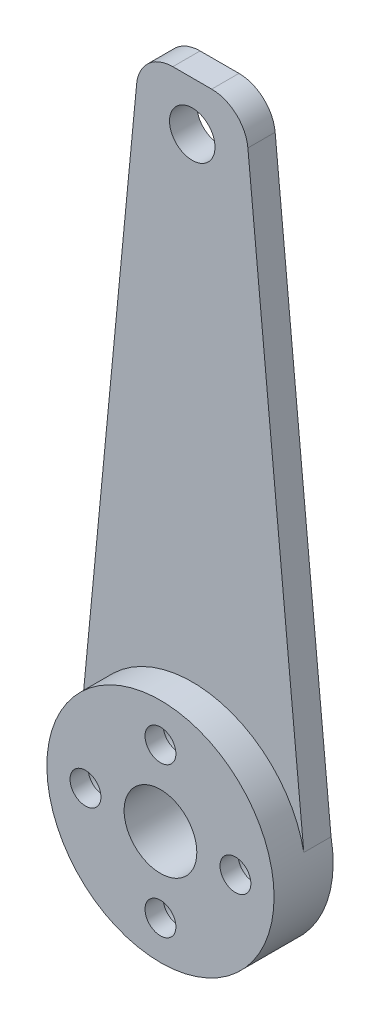
ISO-10303-21;
HEADER;
FILE_DESCRIPTION(('STEP AP214'),'2;1');
FILE_NAME('part.step','',(''),(''),'','','');
FILE_SCHEMA(('AUTOMOTIVE_DESIGN { 1 0 10303 214 1 1 1 1 }'));
ENDSEC;
DATA;
#1=APPLICATION_CONTEXT('core data for automotive mechanical design processes');
#2=APPLICATION_PROTOCOL_DEFINITION('international standard','automotive_design',2000,#1);
#3=PRODUCT_CONTEXT('',#1,'mechanical');
#4=PRODUCT('Part','Part','',(#3));
#5=PRODUCT_RELATED_PRODUCT_CATEGORY('part','',(#4));
#6=PRODUCT_DEFINITION_FORMATION('','',#4);
#7=PRODUCT_DEFINITION_CONTEXT('part definition',#1,'design');
#8=PRODUCT_DEFINITION('design','',#6,#7);
#9=PRODUCT_DEFINITION_SHAPE('','',#8);
#10=(LENGTH_UNIT() NAMED_UNIT(*) SI_UNIT(.MILLI.,.METRE.));
#11=(NAMED_UNIT(*) PLANE_ANGLE_UNIT() SI_UNIT($,.RADIAN.));
#12=(NAMED_UNIT(*) SI_UNIT($,.STERADIAN.) SOLID_ANGLE_UNIT());
#13=UNCERTAINTY_MEASURE_WITH_UNIT(LENGTH_MEASURE(1.E-05),#10,'distance_accuracy_value','');
#14=(GEOMETRIC_REPRESENTATION_CONTEXT(3) GLOBAL_UNCERTAINTY_ASSIGNED_CONTEXT((#13)) GLOBAL_UNIT_ASSIGNED_CONTEXT((#10,
#11,#12)) REPRESENTATION_CONTEXT('',''));
#15=CARTESIAN_POINT('',(0.,0.,0.));
#16=DIRECTION('',(0.,0.,1.));
#17=DIRECTION('',(1.,0.,0.));
#18=AXIS2_PLACEMENT_3D('',#15,#16,#17);
#19=CARTESIAN_POINT('',(0.,-8.25,3.25));
#20=DIRECTION('',(0.,0.,-1.));
#21=DIRECTION('',(-1.,0.,0.));
#22=AXIS2_PLACEMENT_3D('',#19,#20,#21);
#23=CYLINDRICAL_SURFACE('',#22,1.7);
#24=CARTESIAN_POINT('',(0.,-8.25,3.25));
#25=DIRECTION('',(0.,0.,-1.));
#26=DIRECTION('',(-1.,0.,0.));
#27=AXIS2_PLACEMENT_3D('',#24,#25,#26);
#28=CIRCLE('',#27,1.7);
#29=CARTESIAN_POINT('',(-1.7,-8.25,3.25));
#30=VERTEX_POINT('',#29);
#31=EDGE_CURVE('E175',#30,#30,#28,.T.);
#32=ORIENTED_EDGE('',*,*,#31,.F.);
#33=EDGE_LOOP('',(#32));
#34=FACE_BOUND('',#33,.T.);
#35=CARTESIAN_POINT('',(0.,-8.25,1.25));
#36=DIRECTION('',(0.,0.,-1.));
#37=DIRECTION('',(-1.,0.,0.));
#38=AXIS2_PLACEMENT_3D('',#35,#36,#37);
#39=CIRCLE('',#38,1.7);
#40=CARTESIAN_POINT('',(-1.7,-8.25,1.25));
#41=VERTEX_POINT('',#40);
#42=EDGE_CURVE('E39',#41,#41,#39,.F.);
#43=ORIENTED_EDGE('',*,*,#42,.F.);
#44=EDGE_LOOP('',(#43));
#45=FACE_BOUND('',#44,.T.);
#46=ADVANCED_FACE('F35',(#34,#45),#23,.F.);
#47=CARTESIAN_POINT('',(-8.25,0.,3.25));
#48=DIRECTION('',(0.,0.,-1.));
#49=DIRECTION('',(-1.,0.,0.));
#50=AXIS2_PLACEMENT_3D('',#47,#48,#49);
#51=CYLINDRICAL_SURFACE('',#50,1.7);
#52=CARTESIAN_POINT('',(-8.25,0.,3.25));
#53=DIRECTION('',(0.,0.,-1.));
#54=DIRECTION('',(-1.,0.,0.));
#55=AXIS2_PLACEMENT_3D('',#52,#53,#54);
#56=CIRCLE('',#55,1.7);
#57=CARTESIAN_POINT('',(-9.95,0.,3.25));
#58=VERTEX_POINT('',#57);
#59=EDGE_CURVE('E180',#58,#58,#56,.T.);
#60=ORIENTED_EDGE('',*,*,#59,.F.);
#61=EDGE_LOOP('',(#60));
#62=FACE_BOUND('',#61,.T.);
#63=CARTESIAN_POINT('',(-8.25,0.,1.25));
#64=DIRECTION('',(0.,0.,-1.));
#65=DIRECTION('',(-1.,0.,0.));
#66=AXIS2_PLACEMENT_3D('',#63,#64,#65);
#67=CIRCLE('',#66,1.7);
#68=CARTESIAN_POINT('',(-9.95,0.,1.25));
#69=VERTEX_POINT('',#68);
#70=EDGE_CURVE('E157',#69,#69,#67,.F.);
#71=ORIENTED_EDGE('',*,*,#70,.F.);
#72=EDGE_LOOP('',(#71));
#73=FACE_BOUND('',#72,.T.);
#74=ADVANCED_FACE('F208',(#62,#73),#51,.F.);
#75=CARTESIAN_POINT('',(0.,8.25,3.25));
#76=DIRECTION('',(0.,0.,-1.));
#77=DIRECTION('',(-1.,0.,0.));
#78=AXIS2_PLACEMENT_3D('',#75,#76,#77);
#79=CYLINDRICAL_SURFACE('',#78,1.7);
#80=CARTESIAN_POINT('',(0.,8.25,3.25));
#81=DIRECTION('',(0.,0.,-1.));
#82=DIRECTION('',(-1.,0.,0.));
#83=AXIS2_PLACEMENT_3D('',#80,#81,#82);
#84=CIRCLE('',#83,1.7);
#85=CARTESIAN_POINT('',(-1.7,8.25,3.25));
#86=VERTEX_POINT('',#85);
#87=EDGE_CURVE('E123',#86,#86,#84,.T.);
#88=ORIENTED_EDGE('',*,*,#87,.F.);
#89=EDGE_LOOP('',(#88));
#90=FACE_BOUND('',#89,.T.);
#91=CARTESIAN_POINT('',(0.,8.25,1.25));
#92=DIRECTION('',(0.,0.,-1.));
#93=DIRECTION('',(-1.,0.,0.));
#94=AXIS2_PLACEMENT_3D('',#91,#92,#93);
#95=CIRCLE('',#94,1.7);
#96=CARTESIAN_POINT('',(-1.7,8.25,1.25));
#97=VERTEX_POINT('',#96);
#98=EDGE_CURVE('E154',#97,#97,#95,.F.);
#99=ORIENTED_EDGE('',*,*,#98,.F.);
#100=EDGE_LOOP('',(#99));
#101=FACE_BOUND('',#100,.T.);
#102=ADVANCED_FACE('F214',(#90,#101),#79,.F.);
#103=CARTESIAN_POINT('',(8.25,0.,3.25));
#104=DIRECTION('',(0.,0.,-1.));
#105=DIRECTION('',(-1.,0.,0.));
#106=AXIS2_PLACEMENT_3D('',#103,#104,#105);
#107=CYLINDRICAL_SURFACE('',#106,1.7);
#108=CARTESIAN_POINT('',(8.25,0.,3.25));
#109=DIRECTION('',(0.,0.,-1.));
#110=DIRECTION('',(-1.,0.,0.));
#111=AXIS2_PLACEMENT_3D('',#108,#109,#110);
#112=CIRCLE('',#111,1.7);
#113=CARTESIAN_POINT('',(6.55,0.,3.25));
#114=VERTEX_POINT('',#113);
#115=EDGE_CURVE('E118',#114,#114,#112,.T.);
#116=ORIENTED_EDGE('',*,*,#115,.F.);
#117=EDGE_LOOP('',(#116));
#118=FACE_BOUND('',#117,.T.);
#119=CARTESIAN_POINT('',(8.25,0.,1.25));
#120=DIRECTION('',(0.,0.,-1.));
#121=DIRECTION('',(-1.,0.,0.));
#122=AXIS2_PLACEMENT_3D('',#119,#120,#121);
#123=CIRCLE('',#122,1.7);
#124=CARTESIAN_POINT('',(6.55,0.,1.25));
#125=VERTEX_POINT('',#124);
#126=EDGE_CURVE('E151',#125,#125,#123,.F.);
#127=ORIENTED_EDGE('',*,*,#126,.F.);
#128=EDGE_LOOP('',(#127));
#129=FACE_BOUND('',#128,.T.);
#130=ADVANCED_FACE('F238',(#118,#129),#107,.F.);
#131=CARTESIAN_POINT('',(0.,0.,3.25));
#132=DIRECTION('',(0.,0.,-1.));
#133=DIRECTION('',(-1.,0.,0.));
#134=AXIS2_PLACEMENT_3D('',#131,#132,#133);
#135=CYLINDRICAL_SURFACE('',#134,12.5);
#136=DIRECTION('',(0.,0.,-1.));
#137=VECTOR('',#136,1.);
#138=CARTESIAN_POINT('',(-12.2715228885609,2.3790178636418,3.25));
#139=LINE('',#138,#137);
#140=CARTESIAN_POINT('',(-12.2715228885609,2.37901786364178,-0.25));
#141=VERTEX_POINT('',#140);
#142=CARTESIAN_POINT('',(-12.2715228885609,2.37901786364177,-3.25));
#143=VERTEX_POINT('',#142);
#144=EDGE_CURVE('E103',#141,#143,#139,.T.);
#145=ORIENTED_EDGE('',*,*,#144,.T.);
#146=CARTESIAN_POINT('',(0.,0.,-3.25));
#147=DIRECTION('',(0.,0.,1.));
#148=DIRECTION('',(1.,0.,0.));
#149=AXIS2_PLACEMENT_3D('',#146,#147,#148);
#150=CIRCLE('',#149,12.5);
#151=CARTESIAN_POINT('',(12.2715228885609,2.37901786364172,-3.25));
#152=VERTEX_POINT('',#151);
#153=EDGE_CURVE('E90',#143,#152,#150,.T.);
#154=ORIENTED_EDGE('',*,*,#153,.T.);
#155=DIRECTION('',(0.,0.,-1.));
#156=VECTOR('',#155,1.);
#157=CARTESIAN_POINT('',(12.2715228885609,2.37901786364175,3.25));
#158=LINE('',#157,#156);
#159=CARTESIAN_POINT('',(12.2715228885609,2.37901786364178,-0.25));
#160=VERTEX_POINT('',#159);
#161=EDGE_CURVE('E100',#152,#160,#158,.F.);
#162=ORIENTED_EDGE('',*,*,#161,.T.);
#163=CARTESIAN_POINT('',(0.,0.,-0.25));
#164=DIRECTION('',(0.,0.,1.));
#165=DIRECTION('',(1.,0.,0.));
#166=AXIS2_PLACEMENT_3D('',#163,#164,#165);
#167=CIRCLE('',#166,12.5);
#168=EDGE_CURVE('E107',#160,#141,#167,.T.);
#169=ORIENTED_EDGE('',*,*,#168,.T.);
#170=EDGE_LOOP('',(#145,#154,#162,#169));
#171=FACE_BOUND('',#170,.T.);
#172=CARTESIAN_POINT('',(0.,0.,3.25));
#173=DIRECTION('',(0.,0.,1.));
#174=DIRECTION('',(1.,0.,0.));
#175=AXIS2_PLACEMENT_3D('',#172,#173,#174);
#176=CIRCLE('',#175,12.5);
#177=CARTESIAN_POINT('',(12.5,0.,3.25));
#178=VERTEX_POINT('',#177);
#179=EDGE_CURVE('E99',#178,#178,#176,.T.);
#180=ORIENTED_EDGE('',*,*,#179,.F.);
#181=EDGE_LOOP('',(#180));
#182=FACE_BOUND('',#181,.T.);
#183=ADVANCED_FACE('F104',(#171,#182),#135,.T.);
#184=CARTESIAN_POINT('',(0.,0.,3.25));
#185=DIRECTION('',(0.,0.,1.));
#186=DIRECTION('',(1.,0.,0.));
#187=AXIS2_PLACEMENT_3D('',#184,#185,#186);
#188=PLANE('',#187);
#189=CARTESIAN_POINT('',(0.,0.,3.25));
#190=DIRECTION('',(0.,0.,1.));
#191=DIRECTION('',(1.,0.,0.));
#192=AXIS2_PLACEMENT_3D('',#189,#190,#191);
#193=CIRCLE('',#192,4.);
#194=CARTESIAN_POINT('',(4.,0.,3.25));
#195=VERTEX_POINT('',#194);
#196=EDGE_CURVE('E149',#195,#195,#193,.T.);
#197=ORIENTED_EDGE('',*,*,#196,.F.);
#198=EDGE_LOOP('',(#197));
#199=FACE_BOUND('',#198,.T.);
#200=ORIENTED_EDGE('',*,*,#115,.T.);
#201=EDGE_LOOP('',(#200));
#202=FACE_BOUND('',#201,.T.);
#203=ORIENTED_EDGE('',*,*,#87,.T.);
#204=EDGE_LOOP('',(#203));
#205=FACE_BOUND('',#204,.T.);
#206=ORIENTED_EDGE('',*,*,#59,.T.);
#207=EDGE_LOOP('',(#206));
#208=FACE_BOUND('',#207,.T.);
#209=ORIENTED_EDGE('',*,*,#31,.T.);
#210=EDGE_LOOP('',(#209));
#211=FACE_BOUND('',#210,.T.);
#212=ORIENTED_EDGE('',*,*,#179,.T.);
#213=EDGE_LOOP('',(#212));
#214=FACE_BOUND('',#213,.T.);
#215=ADVANCED_FACE('F230',(#199,#202,#205,#208,#211,#214),#188,.T.);
#216=CARTESIAN_POINT('',(0.,0.,-3.25));
#217=DIRECTION('',(0.,0.,1.));
#218=DIRECTION('',(1.,0.,0.));
#219=AXIS2_PLACEMENT_3D('',#216,#217,#218);
#220=PLANE('',#219);
#221=CARTESIAN_POINT('',(0.,8.25,-3.25));
#222=DIRECTION('',(0.,0.,-1.));
#223=DIRECTION('',(-1.,0.,0.));
#224=AXIS2_PLACEMENT_3D('',#221,#222,#223);
#225=CIRCLE('',#224,2.75);
#226=CARTESIAN_POINT('',(-2.75,8.25,-3.25));
#227=VERTEX_POINT('',#226);
#228=EDGE_CURVE('E291',#227,#227,#225,.T.);
#229=ORIENTED_EDGE('',*,*,#228,.F.);
#230=EDGE_LOOP('',(#229));
#231=FACE_BOUND('',#230,.T.);
#232=CARTESIAN_POINT('',(-8.25,0.,-3.25));
#233=DIRECTION('',(0.,0.,-1.));
#234=DIRECTION('',(-1.,0.,0.));
#235=AXIS2_PLACEMENT_3D('',#232,#233,#234);
#236=CIRCLE('',#235,2.75);
#237=CARTESIAN_POINT('',(-11.,0.,-3.25));
#238=VERTEX_POINT('',#237);
#239=EDGE_CURVE('E299',#238,#238,#236,.T.);
#240=ORIENTED_EDGE('',*,*,#239,.F.);
#241=EDGE_LOOP('',(#240));
#242=FACE_BOUND('',#241,.T.);
#243=CARTESIAN_POINT('',(8.25,0.,-3.25));
#244=DIRECTION('',(0.,0.,-1.));
#245=DIRECTION('',(-1.,0.,0.));
#246=AXIS2_PLACEMENT_3D('',#243,#244,#245);
#247=CIRCLE('',#246,2.75);
#248=CARTESIAN_POINT('',(5.5,0.,-3.25));
#249=VERTEX_POINT('',#248);
#250=EDGE_CURVE('E305',#249,#249,#247,.T.);
#251=ORIENTED_EDGE('',*,*,#250,.F.);
#252=EDGE_LOOP('',(#251));
#253=FACE_BOUND('',#252,.T.);
#254=CARTESIAN_POINT('',(0.,-8.25,-3.25));
#255=DIRECTION('',(0.,0.,-1.));
#256=DIRECTION('',(-1.,0.,0.));
#257=AXIS2_PLACEMENT_3D('',#254,#255,#256);
#258=CIRCLE('',#257,2.75);
#259=CARTESIAN_POINT('',(-2.75,-8.25,-3.25));
#260=VERTEX_POINT('',#259);
#261=EDGE_CURVE('E170',#260,#260,#258,.T.);
#262=ORIENTED_EDGE('',*,*,#261,.F.);
#263=EDGE_LOOP('',(#262));
#264=FACE_BOUND('',#263,.T.);
#265=CARTESIAN_POINT('',(0.,64.6965290631007,-3.25));
#266=DIRECTION('',(0.,0.,-1.));
#267=DIRECTION('',(-1.,0.,0.));
#268=AXIS2_PLACEMENT_3D('',#265,#266,#267);
#269=CIRCLE('',#268,2.5);
#270=CARTESIAN_POINT('',(-2.5,64.6965290631007,-3.25));
#271=VERTEX_POINT('',#270);
#272=EDGE_CURVE('E150',#271,#271,#269,.T.);
#273=ORIENTED_EDGE('',*,*,#272,.F.);
#274=EDGE_LOOP('',(#273));
#275=FACE_BOUND('',#274,.T.);
#276=CARTESIAN_POINT('',(0.,0.,-3.25));
#277=DIRECTION('',(0.,0.,1.));
#278=DIRECTION('',(1.,0.,0.));
#279=AXIS2_PLACEMENT_3D('',#276,#277,#278);
#280=CIRCLE('',#279,4.);
#281=CARTESIAN_POINT('',(4.,0.,-3.25));
#282=VERTEX_POINT('',#281);
#283=EDGE_CURVE('E172',#282,#282,#280,.T.);
#284=ORIENTED_EDGE('',*,*,#283,.T.);
#285=EDGE_LOOP('',(#284));
#286=FACE_BOUND('',#285,.T.);
#287=DIRECTION('',(0.0955985588676156,0.995419969431212,0.));
#288=VECTOR('',#287,1.);
#289=CARTESIAN_POINT('',(-5.77219693795847,70.0532476397532,-3.25));
#290=LINE('',#289,#288);
#291=CARTESIAN_POINT('',(-6.11962607165147,66.4356418752236,-3.25));
#292=VERTEX_POINT('',#291);
#293=EDGE_CURVE('E94',#143,#292,#290,.T.);
#294=ORIENTED_EDGE('',*,*,#293,.T.);
#295=CARTESIAN_POINT('',(-2.13794619392663,66.0532476397532,-3.25));
#296=DIRECTION('',(0.,0.,1.));
#297=DIRECTION('',(1.,0.,0.));
#298=AXIS2_PLACEMENT_3D('',#295,#296,#297);
#299=CIRCLE('',#298,4.);
#300=CARTESIAN_POINT('',(-2.13794619392662,70.0532476397532,-3.25));
#301=VERTEX_POINT('',#300);
#302=EDGE_CURVE('E137',#292,#301,#299,.F.);
#303=ORIENTED_EDGE('',*,*,#302,.T.);
#304=DIRECTION('',(1.,0.,0.));
#305=VECTOR('',#304,1.);
#306=CARTESIAN_POINT('',(5.77219693795847,70.0532476397532,-3.25));
#307=LINE('',#306,#305);
#308=CARTESIAN_POINT('',(2.13794619392663,70.0532476397532,-3.25));
#309=VERTEX_POINT('',#308);
#310=EDGE_CURVE('E117',#301,#309,#307,.T.);
#311=ORIENTED_EDGE('',*,*,#310,.T.);
#312=CARTESIAN_POINT('',(2.13794619392663,66.0532476397532,-3.25));
#313=DIRECTION('',(0.,0.,1.));
#314=DIRECTION('',(1.,0.,0.));
#315=AXIS2_PLACEMENT_3D('',#312,#313,#314);
#316=CIRCLE('',#315,4.);
#317=CARTESIAN_POINT('',(6.11962607165148,66.4356418752236,-3.25));
#318=VERTEX_POINT('',#317);
#319=EDGE_CURVE('E135',#309,#318,#316,.F.);
#320=ORIENTED_EDGE('',*,*,#319,.T.);
#321=DIRECTION('',(0.0955985588676156,-0.995419969431212,0.));
#322=VECTOR('',#321,1.);
#323=CARTESIAN_POINT('',(12.5,0.,-3.25));
#324=LINE('',#323,#322);
#325=EDGE_CURVE('E95',#318,#152,#324,.T.);
#326=ORIENTED_EDGE('',*,*,#325,.T.);
#327=ORIENTED_EDGE('',*,*,#153,.F.);
#328=EDGE_LOOP('',(#294,#303,#311,#320,#326,#327));
#329=FACE_BOUND('',#328,.T.);
#330=ADVANCED_FACE('F92',(#231,#242,#253,#264,#275,#286,#329),#220,.F.);
#331=CARTESIAN_POINT('',(12.5,0.,-0.25));
#332=DIRECTION('',(0.995419969431212,0.0955985588676156,0.));
#333=DIRECTION('',(-0.0955985588676156,0.995419969431212,0.));
#334=AXIS2_PLACEMENT_3D('',#331,#332,#333);
#335=PLANE('',#334);
#336=ORIENTED_EDGE('',*,*,#325,.F.);
#337=DIRECTION('',(0.,0.,-1.));
#338=VECTOR('',#337,1.);
#339=CARTESIAN_POINT('',(6.11962607165147,66.4356418752236,-0.25));
#340=LINE('',#339,#338);
#341=CARTESIAN_POINT('',(6.11962607165148,66.4356418752236,-0.25));
#342=VERTEX_POINT('',#341);
#343=EDGE_CURVE('E11',#318,#342,#340,.F.);
#344=ORIENTED_EDGE('',*,*,#343,.T.);
#345=DIRECTION('',(0.0955985588676156,-0.995419969431212,0.));
#346=VECTOR('',#345,1.);
#347=CARTESIAN_POINT('',(12.5,0.,-0.25));
#348=LINE('',#347,#346);
#349=EDGE_CURVE('E111',#342,#160,#348,.T.);
#350=ORIENTED_EDGE('',*,*,#349,.T.);
#351=ORIENTED_EDGE('',*,*,#161,.F.);
#352=EDGE_LOOP('',(#336,#344,#350,#351));
#353=FACE_BOUND('',#352,.T.);
#354=ADVANCED_FACE('F188',(#353),#335,.T.);
#355=CARTESIAN_POINT('',(-5.77219693795847,70.0532476397532,-0.25));
#356=DIRECTION('',(-0.995419969431212,0.0955985588676156,0.));
#357=DIRECTION('',(-0.0955985588676156,-0.995419969431212,0.));
#358=AXIS2_PLACEMENT_3D('',#355,#356,#357);
#359=PLANE('',#358);
#360=DIRECTION('',(0.0955985588676156,0.995419969431212,0.));
#361=VECTOR('',#360,1.);
#362=CARTESIAN_POINT('',(-5.77219693795847,70.0532476397532,-0.25));
#363=LINE('',#362,#361);
#364=CARTESIAN_POINT('',(-6.11962607165147,66.4356418752236,-0.25));
#365=VERTEX_POINT('',#364);
#366=EDGE_CURVE('E128',#141,#365,#363,.T.);
#367=ORIENTED_EDGE('',*,*,#366,.T.);
#368=DIRECTION('',(0.,0.,-1.));
#369=VECTOR('',#368,1.);
#370=CARTESIAN_POINT('',(-6.11962607165147,66.4356418752236,-0.25));
#371=LINE('',#370,#369);
#372=EDGE_CURVE('E116',#365,#292,#371,.T.);
#373=ORIENTED_EDGE('',*,*,#372,.T.);
#374=ORIENTED_EDGE('',*,*,#293,.F.);
#375=ORIENTED_EDGE('',*,*,#144,.F.);
#376=EDGE_LOOP('',(#367,#373,#374,#375));
#377=FACE_BOUND('',#376,.T.);
#378=ADVANCED_FACE('F114',(#377),#359,.T.);
#379=CARTESIAN_POINT('',(5.77219693795847,70.0532476397532,-0.25));
#380=DIRECTION('',(0.,1.,0.));
#381=DIRECTION('',(0.,0.,1.));
#382=AXIS2_PLACEMENT_3D('',#379,#380,#381);
#383=PLANE('',#382);
#384=ORIENTED_EDGE('',*,*,#310,.F.);
#385=DIRECTION('',(0.,0.,-1.));
#386=VECTOR('',#385,1.);
#387=CARTESIAN_POINT('',(-2.13794619392662,70.0532476397532,-0.25));
#388=LINE('',#387,#386);
#389=CARTESIAN_POINT('',(-2.13794619392662,70.0532476397532,-0.25));
#390=VERTEX_POINT('',#389);
#391=EDGE_CURVE('E142',#301,#390,#388,.F.);
#392=ORIENTED_EDGE('',*,*,#391,.T.);
#393=DIRECTION('',(1.,0.,0.));
#394=VECTOR('',#393,1.);
#395=CARTESIAN_POINT('',(5.77219693795847,70.0532476397532,-0.25));
#396=LINE('',#395,#394);
#397=CARTESIAN_POINT('',(2.13794619392663,70.0532476397532,-0.25));
#398=VERTEX_POINT('',#397);
#399=EDGE_CURVE('E185',#390,#398,#396,.T.);
#400=ORIENTED_EDGE('',*,*,#399,.T.);
#401=DIRECTION('',(0.,0.,-1.));
#402=VECTOR('',#401,1.);
#403=CARTESIAN_POINT('',(2.13794619392663,70.0532476397532,-0.25));
#404=LINE('',#403,#402);
#405=EDGE_CURVE('E139',#398,#309,#404,.T.);
#406=ORIENTED_EDGE('',*,*,#405,.T.);
#407=EDGE_LOOP('',(#384,#392,#400,#406));
#408=FACE_BOUND('',#407,.T.);
#409=ADVANCED_FACE('F195',(#408),#383,.T.);
#410=CARTESIAN_POINT('',(0.,0.,-0.25));
#411=DIRECTION('',(0.,0.,1.));
#412=DIRECTION('',(1.,0.,0.));
#413=AXIS2_PLACEMENT_3D('',#410,#411,#412);
#414=PLANE('',#413);
#415=CARTESIAN_POINT('',(0.,64.6965290631007,-0.25));
#416=DIRECTION('',(0.,0.,1.));
#417=DIRECTION('',(1.,0.,0.));
#418=AXIS2_PLACEMENT_3D('',#415,#416,#417);
#419=CIRCLE('',#418,2.5);
#420=CARTESIAN_POINT('',(2.5,64.6965290631007,-0.25));
#421=VERTEX_POINT('',#420);
#422=EDGE_CURVE('E146',#421,#421,#419,.T.);
#423=ORIENTED_EDGE('',*,*,#422,.F.);
#424=EDGE_LOOP('',(#423));
#425=FACE_BOUND('',#424,.T.);
#426=ORIENTED_EDGE('',*,*,#399,.F.);
#427=CARTESIAN_POINT('',(-2.13794619392663,66.0532476397532,-0.25));
#428=DIRECTION('',(0.,0.,1.));
#429=DIRECTION('',(1.,0.,0.));
#430=AXIS2_PLACEMENT_3D('',#427,#428,#429);
#431=CIRCLE('',#430,4.);
#432=EDGE_CURVE('E44',#390,#365,#431,.T.);
#433=ORIENTED_EDGE('',*,*,#432,.T.);
#434=ORIENTED_EDGE('',*,*,#366,.F.);
#435=ORIENTED_EDGE('',*,*,#168,.F.);
#436=ORIENTED_EDGE('',*,*,#349,.F.);
#437=CARTESIAN_POINT('',(2.13794619392663,66.0532476397532,-0.25));
#438=DIRECTION('',(0.,0.,1.));
#439=DIRECTION('',(1.,0.,0.));
#440=AXIS2_PLACEMENT_3D('',#437,#438,#439);
#441=CIRCLE('',#440,4.);
#442=EDGE_CURVE('E57',#342,#398,#441,.T.);
#443=ORIENTED_EDGE('',*,*,#442,.T.);
#444=EDGE_LOOP('',(#426,#433,#434,#435,#436,#443));
#445=FACE_BOUND('',#444,.T.);
#446=ADVANCED_FACE('F189',(#425,#445),#414,.T.);
#447=CARTESIAN_POINT('',(0.,0.,-3.25));
#448=DIRECTION('',(0.,0.,1.));
#449=DIRECTION('',(1.,0.,0.));
#450=AXIS2_PLACEMENT_3D('',#447,#448,#449);
#451=CYLINDRICAL_SURFACE('',#450,4.);
#452=ORIENTED_EDGE('',*,*,#283,.F.);
#453=EDGE_LOOP('',(#452));
#454=FACE_BOUND('',#453,.T.);
#455=ORIENTED_EDGE('',*,*,#196,.T.);
#456=EDGE_LOOP('',(#455));
#457=FACE_BOUND('',#456,.T.);
#458=ADVANCED_FACE('F206',(#454,#457),#451,.F.);
#459=CARTESIAN_POINT('',(-2.13794619392663,66.0532476397532,-0.25));
#460=DIRECTION('',(0.,0.,-1.));
#461=DIRECTION('',(-1.,0.,0.));
#462=AXIS2_PLACEMENT_3D('',#459,#460,#461);
#463=CYLINDRICAL_SURFACE('',#462,4.);
#464=ORIENTED_EDGE('',*,*,#432,.F.);
#465=ORIENTED_EDGE('',*,*,#391,.F.);
#466=ORIENTED_EDGE('',*,*,#302,.F.);
#467=ORIENTED_EDGE('',*,*,#372,.F.);
#468=EDGE_LOOP('',(#464,#465,#466,#467));
#469=FACE_BOUND('',#468,.T.);
#470=ADVANCED_FACE('F192',(#469),#463,.T.);
#471=CARTESIAN_POINT('',(2.13794619392663,66.0532476397532,-0.25));
#472=DIRECTION('',(0.,0.,-1.));
#473=DIRECTION('',(-1.,0.,0.));
#474=AXIS2_PLACEMENT_3D('',#471,#472,#473);
#475=CYLINDRICAL_SURFACE('',#474,4.);
#476=ORIENTED_EDGE('',*,*,#442,.F.);
#477=ORIENTED_EDGE('',*,*,#343,.F.);
#478=ORIENTED_EDGE('',*,*,#319,.F.);
#479=ORIENTED_EDGE('',*,*,#405,.F.);
#480=EDGE_LOOP('',(#476,#477,#478,#479));
#481=FACE_BOUND('',#480,.T.);
#482=ADVANCED_FACE('F37',(#481),#475,.T.);
#483=CARTESIAN_POINT('',(0.,64.6965290631007,3.25));
#484=DIRECTION('',(0.,0.,-1.));
#485=DIRECTION('',(-1.,0.,0.));
#486=AXIS2_PLACEMENT_3D('',#483,#484,#485);
#487=CYLINDRICAL_SURFACE('',#486,2.5);
#488=ORIENTED_EDGE('',*,*,#422,.T.);
#489=EDGE_LOOP('',(#488));
#490=FACE_BOUND('',#489,.T.);
#491=ORIENTED_EDGE('',*,*,#272,.T.);
#492=EDGE_LOOP('',(#491));
#493=FACE_BOUND('',#492,.T.);
#494=ADVANCED_FACE('F198',(#490,#493),#487,.F.);
#495=CARTESIAN_POINT('',(8.25,0.,1.25));
#496=DIRECTION('',(0.,0.,-1.));
#497=DIRECTION('',(-1.,0.,0.));
#498=AXIS2_PLACEMENT_3D('',#495,#496,#497);
#499=PLANE('',#498);
#500=CARTESIAN_POINT('',(8.25,0.,1.25));
#501=DIRECTION('',(0.,0.,-1.));
#502=DIRECTION('',(-1.,0.,0.));
#503=AXIS2_PLACEMENT_3D('',#500,#501,#502);
#504=CIRCLE('',#503,2.75);
#505=CARTESIAN_POINT('',(5.5,0.,1.25));
#506=VERTEX_POINT('',#505);
#507=EDGE_CURVE('E302',#506,#506,#504,.T.);
#508=ORIENTED_EDGE('',*,*,#507,.T.);
#509=EDGE_LOOP('',(#508));
#510=FACE_BOUND('',#509,.T.);
#511=ORIENTED_EDGE('',*,*,#126,.T.);
#512=EDGE_LOOP('',(#511));
#513=FACE_BOUND('',#512,.T.);
#514=ADVANCED_FACE('F203',(#510,#513),#499,.T.);
#515=CARTESIAN_POINT('',(8.25,0.,1.25));
#516=DIRECTION('',(0.,0.,-1.));
#517=DIRECTION('',(-1.,0.,0.));
#518=AXIS2_PLACEMENT_3D('',#515,#516,#517);
#519=CYLINDRICAL_SURFACE('',#518,2.75);
#520=ORIENTED_EDGE('',*,*,#507,.F.);
#521=EDGE_LOOP('',(#520));
#522=FACE_BOUND('',#521,.T.);
#523=ORIENTED_EDGE('',*,*,#250,.T.);
#524=EDGE_LOOP('',(#523));
#525=FACE_BOUND('',#524,.T.);
#526=ADVANCED_FACE('F263',(#522,#525),#519,.F.);
#527=CARTESIAN_POINT('',(0.,8.25,1.25));
#528=DIRECTION('',(0.,0.,-1.));
#529=DIRECTION('',(-1.,0.,0.));
#530=AXIS2_PLACEMENT_3D('',#527,#528,#529);
#531=PLANE('',#530);
#532=CARTESIAN_POINT('',(0.,8.25,1.25));
#533=DIRECTION('',(0.,0.,-1.));
#534=DIRECTION('',(-1.,0.,0.));
#535=AXIS2_PLACEMENT_3D('',#532,#533,#534);
#536=CIRCLE('',#535,2.75);
#537=CARTESIAN_POINT('',(-2.75,8.25,1.25));
#538=VERTEX_POINT('',#537);
#539=EDGE_CURVE('E155',#538,#538,#536,.T.);
#540=ORIENTED_EDGE('',*,*,#539,.T.);
#541=EDGE_LOOP('',(#540));
#542=FACE_BOUND('',#541,.T.);
#543=ORIENTED_EDGE('',*,*,#98,.T.);
#544=EDGE_LOOP('',(#543));
#545=FACE_BOUND('',#544,.T.);
#546=ADVANCED_FACE('F266',(#542,#545),#531,.T.);
#547=CARTESIAN_POINT('',(0.,8.25,1.25));
#548=DIRECTION('',(0.,0.,-1.));
#549=DIRECTION('',(-1.,0.,0.));
#550=AXIS2_PLACEMENT_3D('',#547,#548,#549);
#551=CYLINDRICAL_SURFACE('',#550,2.75);
#552=ORIENTED_EDGE('',*,*,#539,.F.);
#553=EDGE_LOOP('',(#552));
#554=FACE_BOUND('',#553,.T.);
#555=ORIENTED_EDGE('',*,*,#228,.T.);
#556=EDGE_LOOP('',(#555));
#557=FACE_BOUND('',#556,.T.);
#558=ADVANCED_FACE('F277',(#554,#557),#551,.F.);
#559=CARTESIAN_POINT('',(-8.25,0.,1.25));
#560=DIRECTION('',(0.,0.,-1.));
#561=DIRECTION('',(-1.,0.,0.));
#562=AXIS2_PLACEMENT_3D('',#559,#560,#561);
#563=PLANE('',#562);
#564=CARTESIAN_POINT('',(-8.25,0.,1.25));
#565=DIRECTION('',(0.,0.,-1.));
#566=DIRECTION('',(-1.,0.,0.));
#567=AXIS2_PLACEMENT_3D('',#564,#565,#566);
#568=CIRCLE('',#567,2.75);
#569=CARTESIAN_POINT('',(-11.,0.,1.25));
#570=VERTEX_POINT('',#569);
#571=EDGE_CURVE('E294',#570,#570,#568,.T.);
#572=ORIENTED_EDGE('',*,*,#571,.T.);
#573=EDGE_LOOP('',(#572));
#574=FACE_BOUND('',#573,.T.);
#575=ORIENTED_EDGE('',*,*,#70,.T.);
#576=EDGE_LOOP('',(#575));
#577=FACE_BOUND('',#576,.T.);
#578=ADVANCED_FACE('F273',(#574,#577),#563,.T.);
#579=CARTESIAN_POINT('',(-8.25,0.,1.25));
#580=DIRECTION('',(0.,0.,-1.));
#581=DIRECTION('',(-1.,0.,0.));
#582=AXIS2_PLACEMENT_3D('',#579,#580,#581);
#583=CYLINDRICAL_SURFACE('',#582,2.75);
#584=ORIENTED_EDGE('',*,*,#571,.F.);
#585=EDGE_LOOP('',(#584));
#586=FACE_BOUND('',#585,.T.);
#587=ORIENTED_EDGE('',*,*,#239,.T.);
#588=EDGE_LOOP('',(#587));
#589=FACE_BOUND('',#588,.T.);
#590=ADVANCED_FACE('F261',(#586,#589),#583,.F.);
#591=CARTESIAN_POINT('',(0.,-8.25,1.25));
#592=DIRECTION('',(0.,0.,-1.));
#593=DIRECTION('',(-1.,0.,0.));
#594=AXIS2_PLACEMENT_3D('',#591,#592,#593);
#595=PLANE('',#594);
#596=CARTESIAN_POINT('',(0.,-8.25,1.25));
#597=DIRECTION('',(0.,0.,-1.));
#598=DIRECTION('',(-1.,0.,0.));
#599=AXIS2_PLACEMENT_3D('',#596,#597,#598);
#600=CIRCLE('',#599,2.75);
#601=CARTESIAN_POINT('',(-2.75,-8.25,1.25));
#602=VERTEX_POINT('',#601);
#603=EDGE_CURVE('E307',#602,#602,#600,.T.);
#604=ORIENTED_EDGE('',*,*,#603,.T.);
#605=EDGE_LOOP('',(#604));
#606=FACE_BOUND('',#605,.T.);
#607=ORIENTED_EDGE('',*,*,#42,.T.);
#608=EDGE_LOOP('',(#607));
#609=FACE_BOUND('',#608,.T.);
#610=ADVANCED_FACE('F257',(#606,#609),#595,.T.);
#611=CARTESIAN_POINT('',(0.,-8.25,1.25));
#612=DIRECTION('',(0.,0.,-1.));
#613=DIRECTION('',(-1.,0.,0.));
#614=AXIS2_PLACEMENT_3D('',#611,#612,#613);
#615=CYLINDRICAL_SURFACE('',#614,2.75);
#616=ORIENTED_EDGE('',*,*,#603,.F.);
#617=EDGE_LOOP('',(#616));
#618=FACE_BOUND('',#617,.T.);
#619=ORIENTED_EDGE('',*,*,#261,.T.);
#620=EDGE_LOOP('',(#619));
#621=FACE_BOUND('',#620,.T.);
#622=ADVANCED_FACE('F254',(#618,#621),#615,.F.);
#623=CLOSED_SHELL('',(#46,#74,#102,#130,#183,#215,#330,#354,#378,#409,#446,#458,#470,#482,#494,
#514,#526,#546,#558,#578,#590,#610,#622));
#624=MANIFOLD_SOLID_BREP('B2',#623);
#625=ADVANCED_BREP_SHAPE_REPRESENTATION('',(#18,#624),#14);
#626=SHAPE_DEFINITION_REPRESENTATION(#9,#625);
ENDSEC;
END-ISO-10303-21;
